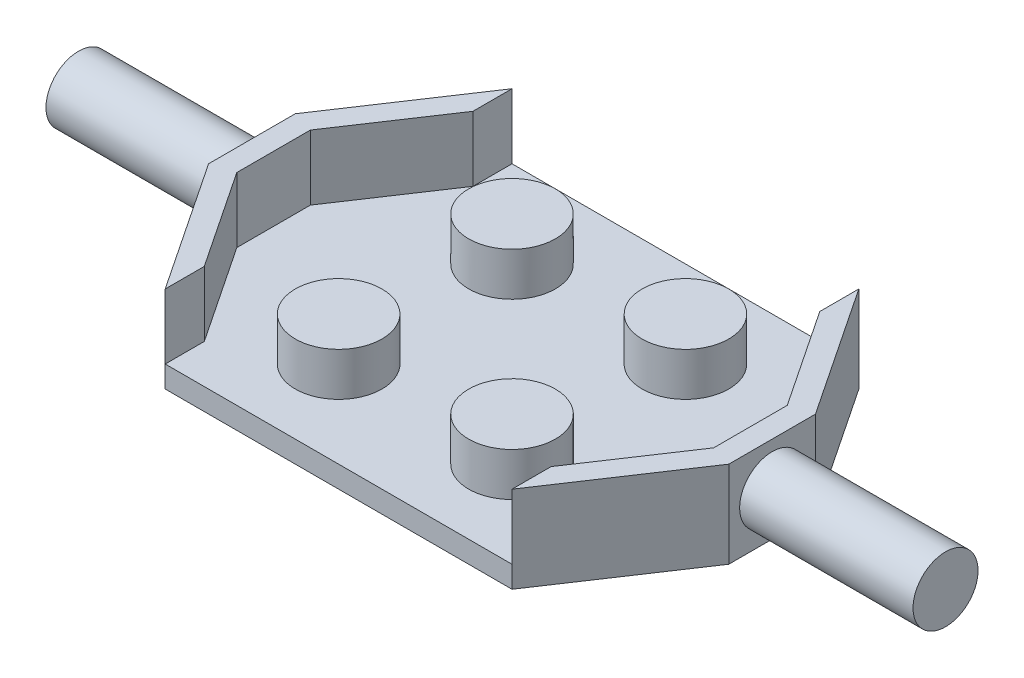
ISO-10303-21;
HEADER;
FILE_DESCRIPTION(('STEP AP214'),'2;1');
FILE_NAME('part.step','',(''),(''),'','','');
FILE_SCHEMA(('AUTOMOTIVE_DESIGN { 1 0 10303 214 1 1 1 1 }'));
ENDSEC;
DATA;
#1=APPLICATION_CONTEXT('core data for automotive mechanical design processes');
#2=APPLICATION_PROTOCOL_DEFINITION('international standard','automotive_design',2000,#1);
#3=PRODUCT_CONTEXT('',#1,'mechanical');
#4=PRODUCT('Part','Part','',(#3));
#5=PRODUCT_RELATED_PRODUCT_CATEGORY('part','',(#4));
#6=PRODUCT_DEFINITION_FORMATION('','',#4);
#7=PRODUCT_DEFINITION_CONTEXT('part definition',#1,'design');
#8=PRODUCT_DEFINITION('design','',#6,#7);
#9=PRODUCT_DEFINITION_SHAPE('','',#8);
#10=(LENGTH_UNIT() NAMED_UNIT(*) SI_UNIT(.MILLI.,.METRE.));
#11=(NAMED_UNIT(*) PLANE_ANGLE_UNIT() SI_UNIT($,.RADIAN.));
#12=(NAMED_UNIT(*) SI_UNIT($,.STERADIAN.) SOLID_ANGLE_UNIT());
#13=UNCERTAINTY_MEASURE_WITH_UNIT(LENGTH_MEASURE(1.E-05),#10,'distance_accuracy_value','');
#14=(GEOMETRIC_REPRESENTATION_CONTEXT(3) GLOBAL_UNCERTAINTY_ASSIGNED_CONTEXT((#13)) GLOBAL_UNIT_ASSIGNED_CONTEXT((#10,
#11,#12)) REPRESENTATION_CONTEXT('',''));
#15=CARTESIAN_POINT('',(0.,0.,0.));
#16=DIRECTION('',(0.,0.,1.));
#17=DIRECTION('',(1.,0.,0.));
#18=AXIS2_PLACEMENT_3D('',#15,#16,#17);
#19=CARTESIAN_POINT('',(-12.,1.,2.));
#20=DIRECTION('',(1.,0.,0.));
#21=DIRECTION('',(0.,0.,-1.));
#22=AXIS2_PLACEMENT_3D('',#19,#20,#21);
#23=PLANE('',#22);
#24=DIRECTION('',(0.,0.,1.));
#25=VECTOR('',#24,1.);
#26=CARTESIAN_POINT('',(-12.,0.,2.));
#27=LINE('',#26,#25);
#28=CARTESIAN_POINT('',(-12.,0.,-2.));
#29=VERTEX_POINT('',#28);
#30=CARTESIAN_POINT('',(-12.,0.,2.));
#31=VERTEX_POINT('',#30);
#32=EDGE_CURVE('E319',#29,#31,#27,.T.);
#33=ORIENTED_EDGE('',*,*,#32,.T.);
#34=DIRECTION('',(0.,-1.,0.));
#35=VECTOR('',#34,1.);
#36=CARTESIAN_POINT('',(-12.,1.,2.));
#37=LINE('',#36,#35);
#38=CARTESIAN_POINT('',(-12.,4.,2.));
#39=VERTEX_POINT('',#38);
#40=EDGE_CURVE('E326',#39,#31,#37,.T.);
#41=ORIENTED_EDGE('',*,*,#40,.F.);
#42=DIRECTION('',(0.,0.,1.));
#43=VECTOR('',#42,1.);
#44=CARTESIAN_POINT('',(-12.,4.,-2.));
#45=LINE('',#44,#43);
#46=CARTESIAN_POINT('',(-12.,4.,-2.));
#47=VERTEX_POINT('',#46);
#48=EDGE_CURVE('E272',#47,#39,#45,.T.);
#49=ORIENTED_EDGE('',*,*,#48,.F.);
#50=DIRECTION('',(0.,-1.,0.));
#51=VECTOR('',#50,1.);
#52=CARTESIAN_POINT('',(-12.,1.,-2.));
#53=LINE('',#52,#51);
#54=EDGE_CURVE('E329',#47,#29,#53,.T.);
#55=ORIENTED_EDGE('',*,*,#54,.T.);
#56=EDGE_LOOP('',(#33,#41,#49,#55));
#57=FACE_BOUND('',#56,.T.);
#58=CARTESIAN_POINT('',(-12.,2.,0.));
#59=DIRECTION('',(1.,0.,0.));
#60=DIRECTION('',(0.,0.,-1.));
#61=AXIS2_PLACEMENT_3D('',#58,#59,#60);
#62=CIRCLE('',#61,1.5);
#63=CARTESIAN_POINT('',(-12.,2.,-1.5));
#64=VERTEX_POINT('',#63);
#65=EDGE_CURVE('E40',#64,#64,#62,.F.);
#66=ORIENTED_EDGE('',*,*,#65,.F.);
#67=EDGE_LOOP('',(#66));
#68=FACE_BOUND('',#67,.T.);
#69=ADVANCED_FACE('F32',(#57,#68),#23,.F.);
#70=CARTESIAN_POINT('',(0.,1.,0.));
#71=DIRECTION('',(0.,-1.,0.));
#72=DIRECTION('',(0.,0.,-1.));
#73=AXIS2_PLACEMENT_3D('',#70,#71,#72);
#74=PLANE('',#73);
#75=CARTESIAN_POINT('',(4.,1.,4.));
#76=DIRECTION('',(0.,-1.,0.));
#77=DIRECTION('',(0.,0.,-1.));
#78=AXIS2_PLACEMENT_3D('',#75,#76,#77);
#79=CIRCLE('',#78,2.);
#80=CARTESIAN_POINT('',(4.,1.,2.));
#81=VERTEX_POINT('',#80);
#82=EDGE_CURVE('E228',#81,#81,#79,.T.);
#83=ORIENTED_EDGE('',*,*,#82,.T.);
#84=EDGE_LOOP('',(#83));
#85=FACE_BOUND('',#84,.T.);
#86=CARTESIAN_POINT('',(4.,1.,-4.));
#87=DIRECTION('',(0.,-1.,0.));
#88=DIRECTION('',(0.,0.,1.));
#89=AXIS2_PLACEMENT_3D('',#86,#87,#88);
#90=CIRCLE('',#89,2.);
#91=CARTESIAN_POINT('',(4.,1.,-2.));
#92=VERTEX_POINT('',#91);
#93=EDGE_CURVE('E232',#92,#92,#90,.T.);
#94=ORIENTED_EDGE('',*,*,#93,.T.);
#95=EDGE_LOOP('',(#94));
#96=FACE_BOUND('',#95,.T.);
#97=CARTESIAN_POINT('',(-4.,1.,4.));
#98=DIRECTION('',(0.,-1.,0.));
#99=DIRECTION('',(0.,0.,-1.));
#100=AXIS2_PLACEMENT_3D('',#97,#98,#99);
#101=CIRCLE('',#100,2.);
#102=CARTESIAN_POINT('',(-4.,1.,2.));
#103=VERTEX_POINT('',#102);
#104=EDGE_CURVE('E338',#103,#103,#101,.F.);
#105=ORIENTED_EDGE('',*,*,#104,.F.);
#106=EDGE_LOOP('',(#105));
#107=FACE_BOUND('',#106,.T.);
#108=CARTESIAN_POINT('',(-4.,1.,-4.));
#109=DIRECTION('',(0.,-1.,0.));
#110=DIRECTION('',(0.,0.,-1.));
#111=AXIS2_PLACEMENT_3D('',#108,#109,#110);
#112=CIRCLE('',#111,2.);
#113=CARTESIAN_POINT('',(-4.,1.,-6.));
#114=VERTEX_POINT('',#113);
#115=EDGE_CURVE('E335',#114,#114,#112,.F.);
#116=ORIENTED_EDGE('',*,*,#115,.F.);
#117=EDGE_LOOP('',(#116));
#118=FACE_BOUND('',#117,.T.);
#119=DIRECTION('',(-0.55470019622523,0.,-0.832050294337843));
#120=VECTOR('',#119,1.);
#121=CARTESIAN_POINT('',(8.,1.,-6.19722436226801));
#122=LINE('',#121,#120);
#123=CARTESIAN_POINT('',(11.,1.,-1.69722436226801));
#124=VERTEX_POINT('',#123);
#125=CARTESIAN_POINT('',(8.,1.,-6.19722436226801));
#126=VERTEX_POINT('',#125);
#127=EDGE_CURVE('E205',#124,#126,#122,.T.);
#128=ORIENTED_EDGE('',*,*,#127,.T.);
#129=DIRECTION('',(0.,0.,-1.));
#130=VECTOR('',#129,1.);
#131=CARTESIAN_POINT('',(8.,1.,-8.));
#132=LINE('',#131,#130);
#133=CARTESIAN_POINT('',(8.,1.,-8.));
#134=VERTEX_POINT('',#133);
#135=EDGE_CURVE('E202',#126,#134,#132,.T.);
#136=ORIENTED_EDGE('',*,*,#135,.T.);
#137=DIRECTION('',(-1.,0.,0.));
#138=VECTOR('',#137,1.);
#139=CARTESIAN_POINT('',(0.,1.,-8.));
#140=LINE('',#139,#138);
#141=CARTESIAN_POINT('',(-8.,1.,-8.));
#142=VERTEX_POINT('',#141);
#143=EDGE_CURVE('E308',#134,#142,#140,.T.);
#144=ORIENTED_EDGE('',*,*,#143,.T.);
#145=DIRECTION('',(0.,0.,-1.));
#146=VECTOR('',#145,1.);
#147=CARTESIAN_POINT('',(-8.,1.,-8.));
#148=LINE('',#147,#146);
#149=CARTESIAN_POINT('',(-8.,1.,-6.197224362268));
#150=VERTEX_POINT('',#149);
#151=EDGE_CURVE('E259',#150,#142,#148,.T.);
#152=ORIENTED_EDGE('',*,*,#151,.F.);
#153=DIRECTION('',(0.554700196225229,0.,-0.832050294337843));
#154=VECTOR('',#153,1.);
#155=CARTESIAN_POINT('',(-8.,1.,-6.197224362268));
#156=LINE('',#155,#154);
#157=CARTESIAN_POINT('',(-11.,1.,-1.69722436226801));
#158=VERTEX_POINT('',#157);
#159=EDGE_CURVE('E279',#158,#150,#156,.T.);
#160=ORIENTED_EDGE('',*,*,#159,.F.);
#161=DIRECTION('',(0.,0.,-1.));
#162=VECTOR('',#161,1.);
#163=CARTESIAN_POINT('',(-11.,1.,-1.69722436226801));
#164=LINE('',#163,#162);
#165=CARTESIAN_POINT('',(-11.,1.,1.69722436226801));
#166=VERTEX_POINT('',#165);
#167=EDGE_CURVE('E52',#166,#158,#164,.T.);
#168=ORIENTED_EDGE('',*,*,#167,.F.);
#169=DIRECTION('',(-0.55470019622523,0.,-0.832050294337843));
#170=VECTOR('',#169,1.);
#171=CARTESIAN_POINT('',(-11.,1.,1.69722436226801));
#172=LINE('',#171,#170);
#173=CARTESIAN_POINT('',(-8.,1.,6.19722436226801));
#174=VERTEX_POINT('',#173);
#175=EDGE_CURVE('E47',#174,#166,#172,.T.);
#176=ORIENTED_EDGE('',*,*,#175,.F.);
#177=DIRECTION('',(0.,0.,-1.));
#178=VECTOR('',#177,1.);
#179=CARTESIAN_POINT('',(-8.,1.,8.));
#180=LINE('',#179,#178);
#181=CARTESIAN_POINT('',(-8.,1.,8.));
#182=VERTEX_POINT('',#181);
#183=EDGE_CURVE('E254',#182,#174,#180,.T.);
#184=ORIENTED_EDGE('',*,*,#183,.F.);
#185=DIRECTION('',(1.,0.,0.));
#186=VECTOR('',#185,1.);
#187=CARTESIAN_POINT('',(0.,1.,8.));
#188=LINE('',#187,#186);
#189=CARTESIAN_POINT('',(8.,1.,8.));
#190=VERTEX_POINT('',#189);
#191=EDGE_CURVE('E310',#182,#190,#188,.T.);
#192=ORIENTED_EDGE('',*,*,#191,.T.);
#193=DIRECTION('',(0.,0.,-1.));
#194=VECTOR('',#193,1.);
#195=CARTESIAN_POINT('',(8.,1.,8.));
#196=LINE('',#195,#194);
#197=CARTESIAN_POINT('',(8.,1.,6.19722436226801));
#198=VERTEX_POINT('',#197);
#199=EDGE_CURVE('E180',#190,#198,#196,.T.);
#200=ORIENTED_EDGE('',*,*,#199,.T.);
#201=DIRECTION('',(0.554700196225229,0.,-0.832050294337843));
#202=VECTOR('',#201,1.);
#203=CARTESIAN_POINT('',(11.,1.,1.697224362268));
#204=LINE('',#203,#202);
#205=CARTESIAN_POINT('',(11.,1.,1.697224362268));
#206=VERTEX_POINT('',#205);
#207=EDGE_CURVE('E212',#198,#206,#204,.T.);
#208=ORIENTED_EDGE('',*,*,#207,.T.);
#209=DIRECTION('',(0.,0.,-1.));
#210=VECTOR('',#209,1.);
#211=CARTESIAN_POINT('',(11.,1.,-1.69722436226801));
#212=LINE('',#211,#210);
#213=EDGE_CURVE('E209',#206,#124,#212,.T.);
#214=ORIENTED_EDGE('',*,*,#213,.T.);
#215=EDGE_LOOP('',(#128,#136,#144,#152,#160,#168,#176,#184,#192,#200,#208,#214));
#216=FACE_BOUND('',#215,.T.);
#217=ADVANCED_FACE('F346',(#85,#96,#107,#118,#216),#74,.F.);
#218=CARTESIAN_POINT('',(0.,1.,-8.));
#219=DIRECTION('',(0.,0.,1.));
#220=DIRECTION('',(1.,0.,0.));
#221=AXIS2_PLACEMENT_3D('',#218,#219,#220);
#222=PLANE('',#221);
#223=DIRECTION('',(-1.,0.,0.));
#224=VECTOR('',#223,1.);
#225=CARTESIAN_POINT('',(0.,0.,-8.));
#226=LINE('',#225,#224);
#227=CARTESIAN_POINT('',(8.,0.,-8.));
#228=VERTEX_POINT('',#227);
#229=CARTESIAN_POINT('',(-8.,0.,-8.));
#230=VERTEX_POINT('',#229);
#231=EDGE_CURVE('E307',#228,#230,#226,.T.);
#232=ORIENTED_EDGE('',*,*,#231,.T.);
#233=DIRECTION('',(0.,-1.,0.));
#234=VECTOR('',#233,1.);
#235=CARTESIAN_POINT('',(-8.,1.,-8.));
#236=LINE('',#235,#234);
#237=EDGE_CURVE('E332',#142,#230,#236,.T.);
#238=ORIENTED_EDGE('',*,*,#237,.F.);
#239=ORIENTED_EDGE('',*,*,#143,.F.);
#240=DIRECTION('',(0.,-1.,0.));
#241=VECTOR('',#240,1.);
#242=CARTESIAN_POINT('',(8.,1.,-8.));
#243=LINE('',#242,#241);
#244=EDGE_CURVE('E246',#134,#228,#243,.T.);
#245=ORIENTED_EDGE('',*,*,#244,.T.);
#246=EDGE_LOOP('',(#232,#238,#239,#245));
#247=FACE_BOUND('',#246,.T.);
#248=ADVANCED_FACE('F34',(#247),#222,.F.);
#249=CARTESIAN_POINT('',(-8.,1.,-8.));
#250=DIRECTION('',(0.832050294337844,0.,0.554700196225229));
#251=DIRECTION('',(0.554700196225229,0.,-0.832050294337844));
#252=AXIS2_PLACEMENT_3D('',#249,#250,#251);
#253=PLANE('',#252);
#254=DIRECTION('',(-0.554700196225229,0.,0.832050294337844));
#255=VECTOR('',#254,1.);
#256=CARTESIAN_POINT('',(-8.,0.,-8.));
#257=LINE('',#256,#255);
#258=EDGE_CURVE('E317',#230,#29,#257,.T.);
#259=ORIENTED_EDGE('',*,*,#258,.T.);
#260=ORIENTED_EDGE('',*,*,#54,.F.);
#261=DIRECTION('',(-0.554700196225229,0.,0.832050294337844));
#262=VECTOR('',#261,1.);
#263=CARTESIAN_POINT('',(-8.,4.,-8.));
#264=LINE('',#263,#262);
#265=CARTESIAN_POINT('',(-8.,4.,-8.));
#266=VERTEX_POINT('',#265);
#267=EDGE_CURVE('E269',#266,#47,#264,.T.);
#268=ORIENTED_EDGE('',*,*,#267,.F.);
#269=DIRECTION('',(0.,-1.,0.));
#270=VECTOR('',#269,1.);
#271=CARTESIAN_POINT('',(-8.,4.,-8.));
#272=LINE('',#271,#270);
#273=EDGE_CURVE('E275',#266,#142,#272,.T.);
#274=ORIENTED_EDGE('',*,*,#273,.T.);
#275=ORIENTED_EDGE('',*,*,#237,.T.);
#276=EDGE_LOOP('',(#259,#260,#268,#274,#275));
#277=FACE_BOUND('',#276,.T.);
#278=ADVANCED_FACE('F357',(#277),#253,.F.);
#279=CARTESIAN_POINT('',(-8.,1.,8.));
#280=DIRECTION('',(0.832050294337843,0.,-0.55470019622523));
#281=DIRECTION('',(-0.55470019622523,0.,-0.832050294337843));
#282=AXIS2_PLACEMENT_3D('',#279,#280,#281);
#283=PLANE('',#282);
#284=DIRECTION('',(0.55470019622523,0.,0.832050294337843));
#285=VECTOR('',#284,1.);
#286=CARTESIAN_POINT('',(-8.,0.,8.));
#287=LINE('',#286,#285);
#288=CARTESIAN_POINT('',(-8.,0.,8.));
#289=VERTEX_POINT('',#288);
#290=EDGE_CURVE('E321',#31,#289,#287,.T.);
#291=ORIENTED_EDGE('',*,*,#290,.T.);
#292=DIRECTION('',(0.,-1.,0.));
#293=VECTOR('',#292,1.);
#294=CARTESIAN_POINT('',(-8.,1.,8.));
#295=LINE('',#294,#293);
#296=EDGE_CURVE('E314',#182,#289,#295,.T.);
#297=ORIENTED_EDGE('',*,*,#296,.F.);
#298=DIRECTION('',(0.,-1.,0.));
#299=VECTOR('',#298,1.);
#300=CARTESIAN_POINT('',(-8.,4.,8.));
#301=LINE('',#300,#299);
#302=CARTESIAN_POINT('',(-8.,4.,8.));
#303=VERTEX_POINT('',#302);
#304=EDGE_CURVE('E298',#303,#182,#301,.T.);
#305=ORIENTED_EDGE('',*,*,#304,.F.);
#306=DIRECTION('',(0.55470019622523,0.,0.832050294337843));
#307=VECTOR('',#306,1.);
#308=CARTESIAN_POINT('',(-12.,4.,2.));
#309=LINE('',#308,#307);
#310=EDGE_CURVE('E255',#39,#303,#309,.T.);
#311=ORIENTED_EDGE('',*,*,#310,.F.);
#312=ORIENTED_EDGE('',*,*,#40,.T.);
#313=EDGE_LOOP('',(#291,#297,#305,#311,#312));
#314=FACE_BOUND('',#313,.T.);
#315=ADVANCED_FACE('F355',(#314),#283,.F.);
#316=CARTESIAN_POINT('',(0.,1.,8.));
#317=DIRECTION('',(0.,0.,-1.));
#318=DIRECTION('',(-1.,0.,0.));
#319=AXIS2_PLACEMENT_3D('',#316,#317,#318);
#320=PLANE('',#319);
#321=DIRECTION('',(1.,0.,0.));
#322=VECTOR('',#321,1.);
#323=CARTESIAN_POINT('',(0.,0.,8.));
#324=LINE('',#323,#322);
#325=CARTESIAN_POINT('',(8.,0.,8.));
#326=VERTEX_POINT('',#325);
#327=EDGE_CURVE('E311',#289,#326,#324,.T.);
#328=ORIENTED_EDGE('',*,*,#327,.T.);
#329=DIRECTION('',(0.,-1.,0.));
#330=VECTOR('',#329,1.);
#331=CARTESIAN_POINT('',(8.,1.,8.));
#332=LINE('',#331,#330);
#333=EDGE_CURVE('E168',#190,#326,#332,.T.);
#334=ORIENTED_EDGE('',*,*,#333,.F.);
#335=ORIENTED_EDGE('',*,*,#191,.F.);
#336=ORIENTED_EDGE('',*,*,#296,.T.);
#337=EDGE_LOOP('',(#328,#334,#335,#336));
#338=FACE_BOUND('',#337,.T.);
#339=ADVANCED_FACE('F364',(#338),#320,.F.);
#340=CARTESIAN_POINT('',(0.,0.,0.));
#341=DIRECTION('',(0.,-1.,0.));
#342=DIRECTION('',(0.,0.,-1.));
#343=AXIS2_PLACEMENT_3D('',#340,#341,#342);
#344=PLANE('',#343);
#345=ORIENTED_EDGE('',*,*,#231,.F.);
#346=DIRECTION('',(0.554700196225229,0.,0.832050294337843));
#347=VECTOR('',#346,1.);
#348=CARTESIAN_POINT('',(8.,0.,-8.));
#349=LINE('',#348,#347);
#350=CARTESIAN_POINT('',(12.,0.,-2.));
#351=VERTEX_POINT('',#350);
#352=EDGE_CURVE('E243',#228,#351,#349,.T.);
#353=ORIENTED_EDGE('',*,*,#352,.T.);
#354=DIRECTION('',(0.,0.,1.));
#355=VECTOR('',#354,1.);
#356=CARTESIAN_POINT('',(12.,0.,2.));
#357=LINE('',#356,#355);
#358=CARTESIAN_POINT('',(12.,0.,2.));
#359=VERTEX_POINT('',#358);
#360=EDGE_CURVE('E241',#351,#359,#357,.T.);
#361=ORIENTED_EDGE('',*,*,#360,.T.);
#362=DIRECTION('',(-0.554700196225229,0.,0.832050294337843));
#363=VECTOR('',#362,1.);
#364=CARTESIAN_POINT('',(8.,0.,8.));
#365=LINE('',#364,#363);
#366=EDGE_CURVE('E163',#359,#326,#365,.T.);
#367=ORIENTED_EDGE('',*,*,#366,.T.);
#368=ORIENTED_EDGE('',*,*,#327,.F.);
#369=ORIENTED_EDGE('',*,*,#290,.F.);
#370=ORIENTED_EDGE('',*,*,#32,.F.);
#371=ORIENTED_EDGE('',*,*,#258,.F.);
#372=EDGE_LOOP('',(#345,#353,#361,#367,#368,#369,#370,#371));
#373=FACE_BOUND('',#372,.T.);
#374=ADVANCED_FACE('F373',(#373),#344,.T.);
#375=CARTESIAN_POINT('',(-4.,3.,-4.));
#376=DIRECTION('',(0.,-1.,0.));
#377=DIRECTION('',(0.,0.,-1.));
#378=AXIS2_PLACEMENT_3D('',#375,#376,#377);
#379=CYLINDRICAL_SURFACE('',#378,2.);
#380=CARTESIAN_POINT('',(-4.,3.,-4.));
#381=DIRECTION('',(0.,1.,0.));
#382=DIRECTION('',(0.,0.,1.));
#383=AXIS2_PLACEMENT_3D('',#380,#381,#382);
#384=CIRCLE('',#383,2.);
#385=CARTESIAN_POINT('',(-4.,3.,-2.));
#386=VERTEX_POINT('',#385);
#387=EDGE_CURVE('E304',#386,#386,#384,.T.);
#388=ORIENTED_EDGE('',*,*,#387,.F.);
#389=EDGE_LOOP('',(#388));
#390=FACE_BOUND('',#389,.T.);
#391=ORIENTED_EDGE('',*,*,#115,.T.);
#392=EDGE_LOOP('',(#391));
#393=FACE_BOUND('',#392,.T.);
#394=ADVANCED_FACE('F424',(#390,#393),#379,.T.);
#395=CARTESIAN_POINT('',(-4.,3.,-4.));
#396=DIRECTION('',(0.,1.,0.));
#397=DIRECTION('',(0.,0.,1.));
#398=AXIS2_PLACEMENT_3D('',#395,#396,#397);
#399=PLANE('',#398);
#400=ORIENTED_EDGE('',*,*,#387,.T.);
#401=EDGE_LOOP('',(#400));
#402=FACE_BOUND('',#401,.T.);
#403=ADVANCED_FACE('F420',(#402),#399,.T.);
#404=CARTESIAN_POINT('',(-4.,3.,4.));
#405=DIRECTION('',(0.,-1.,0.));
#406=DIRECTION('',(0.,0.,-1.));
#407=AXIS2_PLACEMENT_3D('',#404,#405,#406);
#408=CYLINDRICAL_SURFACE('',#407,2.);
#409=CARTESIAN_POINT('',(-4.,3.,4.));
#410=DIRECTION('',(0.,1.,0.));
#411=DIRECTION('',(0.,0.,-1.));
#412=AXIS2_PLACEMENT_3D('',#409,#410,#411);
#413=CIRCLE('',#412,2.);
#414=CARTESIAN_POINT('',(-4.,3.,2.));
#415=VERTEX_POINT('',#414);
#416=EDGE_CURVE('E301',#415,#415,#413,.T.);
#417=ORIENTED_EDGE('',*,*,#416,.F.);
#418=EDGE_LOOP('',(#417));
#419=FACE_BOUND('',#418,.T.);
#420=ORIENTED_EDGE('',*,*,#104,.T.);
#421=EDGE_LOOP('',(#420));
#422=FACE_BOUND('',#421,.T.);
#423=ADVANCED_FACE('F416',(#419,#422),#408,.T.);
#424=CARTESIAN_POINT('',(-4.,3.,4.));
#425=DIRECTION('',(0.,-1.,0.));
#426=DIRECTION('',(0.,0.,-1.));
#427=AXIS2_PLACEMENT_3D('',#424,#425,#426);
#428=PLANE('',#427);
#429=ORIENTED_EDGE('',*,*,#416,.T.);
#430=EDGE_LOOP('',(#429));
#431=FACE_BOUND('',#430,.T.);
#432=ADVANCED_FACE('F410',(#431),#428,.F.);
#433=CARTESIAN_POINT('',(-8.,4.,8.));
#434=DIRECTION('',(-1.,0.,0.));
#435=DIRECTION('',(0.,0.,1.));
#436=AXIS2_PLACEMENT_3D('',#433,#434,#435);
#437=PLANE('',#436);
#438=ORIENTED_EDGE('',*,*,#183,.T.);
#439=DIRECTION('',(0.,-1.,0.));
#440=VECTOR('',#439,1.);
#441=CARTESIAN_POINT('',(-8.,4.,6.19722436226801));
#442=LINE('',#441,#440);
#443=CARTESIAN_POINT('',(-8.,4.,6.19722436226801));
#444=VERTEX_POINT('',#443);
#445=EDGE_CURVE('E295',#444,#174,#442,.T.);
#446=ORIENTED_EDGE('',*,*,#445,.F.);
#447=DIRECTION('',(0.,0.,-1.));
#448=VECTOR('',#447,1.);
#449=CARTESIAN_POINT('',(-8.,4.,8.));
#450=LINE('',#449,#448);
#451=EDGE_CURVE('E258',#303,#444,#450,.T.);
#452=ORIENTED_EDGE('',*,*,#451,.F.);
#453=ORIENTED_EDGE('',*,*,#304,.T.);
#454=EDGE_LOOP('',(#438,#446,#452,#453));
#455=FACE_BOUND('',#454,.T.);
#456=ADVANCED_FACE('F383',(#455),#437,.F.);
#457=CARTESIAN_POINT('',(-11.,4.,1.69722436226801));
#458=DIRECTION('',(-0.832050294337843,0.,0.554700196225229));
#459=DIRECTION('',(0.55470019622523,0.,0.832050294337843));
#460=AXIS2_PLACEMENT_3D('',#457,#458,#459);
#461=PLANE('',#460);
#462=ORIENTED_EDGE('',*,*,#175,.T.);
#463=DIRECTION('',(0.,-1.,0.));
#464=VECTOR('',#463,1.);
#465=CARTESIAN_POINT('',(-11.,4.,1.69722436226801));
#466=LINE('',#465,#464);
#467=CARTESIAN_POINT('',(-11.,4.,1.69722436226801));
#468=VERTEX_POINT('',#467);
#469=EDGE_CURVE('E292',#468,#166,#466,.T.);
#470=ORIENTED_EDGE('',*,*,#469,.F.);
#471=DIRECTION('',(-0.55470019622523,0.,-0.832050294337843));
#472=VECTOR('',#471,1.);
#473=CARTESIAN_POINT('',(-11.,4.,1.69722436226801));
#474=LINE('',#473,#472);
#475=EDGE_CURVE('E261',#444,#468,#474,.T.);
#476=ORIENTED_EDGE('',*,*,#475,.F.);
#477=ORIENTED_EDGE('',*,*,#445,.T.);
#478=EDGE_LOOP('',(#462,#470,#476,#477));
#479=FACE_BOUND('',#478,.T.);
#480=ADVANCED_FACE('F402',(#479),#461,.F.);
#481=CARTESIAN_POINT('',(-11.,4.,-1.69722436226801));
#482=DIRECTION('',(-1.,0.,0.));
#483=DIRECTION('',(0.,0.,1.));
#484=AXIS2_PLACEMENT_3D('',#481,#482,#483);
#485=PLANE('',#484);
#486=ORIENTED_EDGE('',*,*,#167,.T.);
#487=DIRECTION('',(0.,-1.,0.));
#488=VECTOR('',#487,1.);
#489=CARTESIAN_POINT('',(-11.,4.,-1.69722436226801));
#490=LINE('',#489,#488);
#491=CARTESIAN_POINT('',(-11.,4.,-1.69722436226801));
#492=VERTEX_POINT('',#491);
#493=EDGE_CURVE('E289',#492,#158,#490,.T.);
#494=ORIENTED_EDGE('',*,*,#493,.F.);
#495=DIRECTION('',(0.,0.,-1.));
#496=VECTOR('',#495,1.);
#497=CARTESIAN_POINT('',(-11.,4.,-1.69722436226801));
#498=LINE('',#497,#496);
#499=EDGE_CURVE('E263',#468,#492,#498,.T.);
#500=ORIENTED_EDGE('',*,*,#499,.F.);
#501=ORIENTED_EDGE('',*,*,#469,.T.);
#502=EDGE_LOOP('',(#486,#494,#500,#501));
#503=FACE_BOUND('',#502,.T.);
#504=ADVANCED_FACE('F398',(#503),#485,.F.);
#505=CARTESIAN_POINT('',(-8.,4.,-6.197224362268));
#506=DIRECTION('',(-0.832050294337843,0.,-0.554700196225229));
#507=DIRECTION('',(-0.554700196225229,0.,0.832050294337844));
#508=AXIS2_PLACEMENT_3D('',#505,#506,#507);
#509=PLANE('',#508);
#510=ORIENTED_EDGE('',*,*,#159,.T.);
#511=DIRECTION('',(0.,-1.,0.));
#512=VECTOR('',#511,1.);
#513=CARTESIAN_POINT('',(-8.,4.,-6.197224362268));
#514=LINE('',#513,#512);
#515=CARTESIAN_POINT('',(-8.,4.,-6.197224362268));
#516=VERTEX_POINT('',#515);
#517=EDGE_CURVE('E286',#516,#150,#514,.T.);
#518=ORIENTED_EDGE('',*,*,#517,.F.);
#519=DIRECTION('',(0.554700196225229,0.,-0.832050294337843));
#520=VECTOR('',#519,1.);
#521=CARTESIAN_POINT('',(-8.,4.,-6.197224362268));
#522=LINE('',#521,#520);
#523=EDGE_CURVE('E265',#492,#516,#522,.T.);
#524=ORIENTED_EDGE('',*,*,#523,.F.);
#525=ORIENTED_EDGE('',*,*,#493,.T.);
#526=EDGE_LOOP('',(#510,#518,#524,#525));
#527=FACE_BOUND('',#526,.T.);
#528=ADVANCED_FACE('F393',(#527),#509,.F.);
#529=CARTESIAN_POINT('',(-8.,4.,-8.));
#530=DIRECTION('',(-1.,0.,0.));
#531=DIRECTION('',(0.,0.,1.));
#532=AXIS2_PLACEMENT_3D('',#529,#530,#531);
#533=PLANE('',#532);
#534=ORIENTED_EDGE('',*,*,#151,.T.);
#535=ORIENTED_EDGE('',*,*,#273,.F.);
#536=DIRECTION('',(0.,0.,-1.));
#537=VECTOR('',#536,1.);
#538=CARTESIAN_POINT('',(-8.,4.,-8.));
#539=LINE('',#538,#537);
#540=EDGE_CURVE('E267',#516,#266,#539,.T.);
#541=ORIENTED_EDGE('',*,*,#540,.F.);
#542=ORIENTED_EDGE('',*,*,#517,.T.);
#543=EDGE_LOOP('',(#534,#535,#541,#542));
#544=FACE_BOUND('',#543,.T.);
#545=ADVANCED_FACE('F389',(#544),#533,.F.);
#546=CARTESIAN_POINT('',(0.,4.,0.));
#547=DIRECTION('',(0.,-1.,0.));
#548=DIRECTION('',(0.,0.,-1.));
#549=AXIS2_PLACEMENT_3D('',#546,#547,#548);
#550=PLANE('',#549);
#551=ORIENTED_EDGE('',*,*,#310,.T.);
#552=ORIENTED_EDGE('',*,*,#451,.T.);
#553=ORIENTED_EDGE('',*,*,#475,.T.);
#554=ORIENTED_EDGE('',*,*,#499,.T.);
#555=ORIENTED_EDGE('',*,*,#523,.T.);
#556=ORIENTED_EDGE('',*,*,#540,.T.);
#557=ORIENTED_EDGE('',*,*,#267,.T.);
#558=ORIENTED_EDGE('',*,*,#48,.T.);
#559=EDGE_LOOP('',(#551,#552,#553,#554,#555,#556,#557,#558));
#560=FACE_BOUND('',#559,.T.);
#561=ADVANCED_FACE('F385',(#560),#550,.F.);
#562=CARTESIAN_POINT('',(-20.,2.,0.));
#563=DIRECTION('',(1.,0.,0.));
#564=DIRECTION('',(0.,0.,-1.));
#565=AXIS2_PLACEMENT_3D('',#562,#563,#564);
#566=CYLINDRICAL_SURFACE('',#565,1.5);
#567=CARTESIAN_POINT('',(-20.,2.,0.));
#568=DIRECTION('',(-1.,0.,0.));
#569=DIRECTION('',(0.,0.,1.));
#570=AXIS2_PLACEMENT_3D('',#567,#568,#569);
#571=CIRCLE('',#570,1.5);
#572=CARTESIAN_POINT('',(-20.,2.,1.5));
#573=VERTEX_POINT('',#572);
#574=EDGE_CURVE('E251',#573,#573,#571,.T.);
#575=ORIENTED_EDGE('',*,*,#574,.F.);
#576=EDGE_LOOP('',(#575));
#577=FACE_BOUND('',#576,.T.);
#578=ORIENTED_EDGE('',*,*,#65,.T.);
#579=EDGE_LOOP('',(#578));
#580=FACE_BOUND('',#579,.T.);
#581=ADVANCED_FACE('F343',(#577,#580),#566,.T.);
#582=CARTESIAN_POINT('',(-20.,2.,0.));
#583=DIRECTION('',(-1.,0.,0.));
#584=DIRECTION('',(0.,0.,1.));
#585=AXIS2_PLACEMENT_3D('',#582,#583,#584);
#586=PLANE('',#585);
#587=ORIENTED_EDGE('',*,*,#574,.T.);
#588=EDGE_LOOP('',(#587));
#589=FACE_BOUND('',#588,.T.);
#590=ADVANCED_FACE('F510',(#589),#586,.T.);
#591=CARTESIAN_POINT('',(8.,1.,8.));
#592=DIRECTION('',(0.832050294337843,0.,0.554700196225229));
#593=DIRECTION('',(0.554700196225229,0.,-0.832050294337843));
#594=AXIS2_PLACEMENT_3D('',#591,#592,#593);
#595=PLANE('',#594);
#596=ORIENTED_EDGE('',*,*,#366,.F.);
#597=DIRECTION('',(0.,-1.,0.));
#598=VECTOR('',#597,1.);
#599=CARTESIAN_POINT('',(12.,1.,2.));
#600=LINE('',#599,#598);
#601=CARTESIAN_POINT('',(12.,4.,2.));
#602=VERTEX_POINT('',#601);
#603=EDGE_CURVE('E156',#602,#359,#600,.T.);
#604=ORIENTED_EDGE('',*,*,#603,.F.);
#605=DIRECTION('',(-0.554700196225229,0.,0.832050294337843));
#606=VECTOR('',#605,1.);
#607=CARTESIAN_POINT('',(12.,4.,2.));
#608=LINE('',#607,#606);
#609=CARTESIAN_POINT('',(8.,4.,8.));
#610=VERTEX_POINT('',#609);
#611=EDGE_CURVE('E159',#602,#610,#608,.T.);
#612=ORIENTED_EDGE('',*,*,#611,.T.);
#613=DIRECTION('',(0.,-1.,0.));
#614=VECTOR('',#613,1.);
#615=CARTESIAN_POINT('',(8.,4.,8.));
#616=LINE('',#615,#614);
#617=EDGE_CURVE('E201',#610,#190,#616,.T.);
#618=ORIENTED_EDGE('',*,*,#617,.T.);
#619=ORIENTED_EDGE('',*,*,#333,.T.);
#620=EDGE_LOOP('',(#596,#604,#612,#618,#619));
#621=FACE_BOUND('',#620,.T.);
#622=ADVANCED_FACE('F158',(#621),#595,.T.);
#623=CARTESIAN_POINT('',(12.,1.,2.));
#624=DIRECTION('',(1.,0.,0.));
#625=DIRECTION('',(0.,0.,-1.));
#626=AXIS2_PLACEMENT_3D('',#623,#624,#625);
#627=PLANE('',#626);
#628=CARTESIAN_POINT('',(12.,2.,0.));
#629=DIRECTION('',(1.,0.,0.));
#630=DIRECTION('',(0.,0.,-1.));
#631=AXIS2_PLACEMENT_3D('',#628,#629,#630);
#632=CIRCLE('',#631,1.5);
#633=CARTESIAN_POINT('',(12.,2.,-1.5));
#634=VERTEX_POINT('',#633);
#635=EDGE_CURVE('E11',#634,#634,#632,.T.);
#636=ORIENTED_EDGE('',*,*,#635,.F.);
#637=EDGE_LOOP('',(#636));
#638=FACE_BOUND('',#637,.T.);
#639=ORIENTED_EDGE('',*,*,#360,.F.);
#640=DIRECTION('',(0.,-1.,0.));
#641=VECTOR('',#640,1.);
#642=CARTESIAN_POINT('',(12.,1.,-2.));
#643=LINE('',#642,#641);
#644=CARTESIAN_POINT('',(12.,4.,-2.));
#645=VERTEX_POINT('',#644);
#646=EDGE_CURVE('E169',#645,#351,#643,.T.);
#647=ORIENTED_EDGE('',*,*,#646,.F.);
#648=DIRECTION('',(0.,0.,1.));
#649=VECTOR('',#648,1.);
#650=CARTESIAN_POINT('',(12.,4.,-2.));
#651=LINE('',#650,#649);
#652=EDGE_CURVE('E175',#645,#602,#651,.T.);
#653=ORIENTED_EDGE('',*,*,#652,.T.);
#654=ORIENTED_EDGE('',*,*,#603,.T.);
#655=EDGE_LOOP('',(#639,#647,#653,#654));
#656=FACE_BOUND('',#655,.T.);
#657=ADVANCED_FACE('F182',(#638,#656),#627,.T.);
#658=CARTESIAN_POINT('',(8.,1.,-8.));
#659=DIRECTION('',(0.832050294337843,0.,-0.554700196225229));
#660=DIRECTION('',(-0.554700196225229,0.,-0.832050294337843));
#661=AXIS2_PLACEMENT_3D('',#658,#659,#660);
#662=PLANE('',#661);
#663=ORIENTED_EDGE('',*,*,#352,.F.);
#664=ORIENTED_EDGE('',*,*,#244,.F.);
#665=DIRECTION('',(0.,-1.,0.));
#666=VECTOR('',#665,1.);
#667=CARTESIAN_POINT('',(8.,4.,-8.));
#668=LINE('',#667,#666);
#669=CARTESIAN_POINT('',(8.,4.,-8.));
#670=VERTEX_POINT('',#669);
#671=EDGE_CURVE('E226',#670,#134,#668,.T.);
#672=ORIENTED_EDGE('',*,*,#671,.F.);
#673=DIRECTION('',(0.554700196225229,0.,0.832050294337843));
#674=VECTOR('',#673,1.);
#675=CARTESIAN_POINT('',(8.,4.,-8.));
#676=LINE('',#675,#674);
#677=EDGE_CURVE('E183',#670,#645,#676,.T.);
#678=ORIENTED_EDGE('',*,*,#677,.T.);
#679=ORIENTED_EDGE('',*,*,#646,.T.);
#680=EDGE_LOOP('',(#663,#664,#672,#678,#679));
#681=FACE_BOUND('',#680,.T.);
#682=ADVANCED_FACE('F566',(#681),#662,.T.);
#683=CARTESIAN_POINT('',(4.,3.,-4.));
#684=DIRECTION('',(0.,-1.,0.));
#685=DIRECTION('',(0.,0.,-1.));
#686=AXIS2_PLACEMENT_3D('',#683,#684,#685);
#687=CYLINDRICAL_SURFACE('',#686,2.);
#688=CARTESIAN_POINT('',(4.,3.,-4.));
#689=DIRECTION('',(0.,-1.,0.));
#690=DIRECTION('',(0.,0.,1.));
#691=AXIS2_PLACEMENT_3D('',#688,#689,#690);
#692=CIRCLE('',#691,2.);
#693=CARTESIAN_POINT('',(4.,3.,-2.));
#694=VERTEX_POINT('',#693);
#695=EDGE_CURVE('E235',#694,#694,#692,.T.);
#696=ORIENTED_EDGE('',*,*,#695,.T.);
#697=EDGE_LOOP('',(#696));
#698=FACE_BOUND('',#697,.T.);
#699=ORIENTED_EDGE('',*,*,#93,.F.);
#700=EDGE_LOOP('',(#699));
#701=FACE_BOUND('',#700,.T.);
#702=ADVANCED_FACE('F577',(#698,#701),#687,.T.);
#703=CARTESIAN_POINT('',(4.,3.,-4.));
#704=DIRECTION('',(0.,1.,0.));
#705=DIRECTION('',(0.,0.,1.));
#706=AXIS2_PLACEMENT_3D('',#703,#704,#705);
#707=PLANE('',#706);
#708=ORIENTED_EDGE('',*,*,#695,.F.);
#709=EDGE_LOOP('',(#708));
#710=FACE_BOUND('',#709,.T.);
#711=ADVANCED_FACE('F589',(#710),#707,.T.);
#712=CARTESIAN_POINT('',(4.,3.,4.));
#713=DIRECTION('',(0.,-1.,0.));
#714=DIRECTION('',(0.,0.,-1.));
#715=AXIS2_PLACEMENT_3D('',#712,#713,#714);
#716=CYLINDRICAL_SURFACE('',#715,2.);
#717=CARTESIAN_POINT('',(4.,3.,4.));
#718=DIRECTION('',(0.,-1.,0.));
#719=DIRECTION('',(0.,0.,-1.));
#720=AXIS2_PLACEMENT_3D('',#717,#718,#719);
#721=CIRCLE('',#720,2.);
#722=CARTESIAN_POINT('',(4.,3.,2.));
#723=VERTEX_POINT('',#722);
#724=EDGE_CURVE('E229',#723,#723,#721,.T.);
#725=ORIENTED_EDGE('',*,*,#724,.T.);
#726=EDGE_LOOP('',(#725));
#727=FACE_BOUND('',#726,.T.);
#728=ORIENTED_EDGE('',*,*,#82,.F.);
#729=EDGE_LOOP('',(#728));
#730=FACE_BOUND('',#729,.T.);
#731=ADVANCED_FACE('F598',(#727,#730),#716,.T.);
#732=CARTESIAN_POINT('',(4.,3.,4.));
#733=DIRECTION('',(0.,-1.,0.));
#734=DIRECTION('',(0.,0.,-1.));
#735=AXIS2_PLACEMENT_3D('',#732,#733,#734);
#736=PLANE('',#735);
#737=ORIENTED_EDGE('',*,*,#724,.F.);
#738=EDGE_LOOP('',(#737));
#739=FACE_BOUND('',#738,.T.);
#740=ADVANCED_FACE('F606',(#739),#736,.F.);
#741=CARTESIAN_POINT('',(8.,4.,-8.));
#742=DIRECTION('',(-1.,0.,0.));
#743=DIRECTION('',(0.,0.,1.));
#744=AXIS2_PLACEMENT_3D('',#741,#742,#743);
#745=PLANE('',#744);
#746=ORIENTED_EDGE('',*,*,#135,.F.);
#747=DIRECTION('',(0.,-1.,0.));
#748=VECTOR('',#747,1.);
#749=CARTESIAN_POINT('',(8.,4.,-6.19722436226801));
#750=LINE('',#749,#748);
#751=CARTESIAN_POINT('',(8.,4.,-6.19722436226801));
#752=VERTEX_POINT('',#751);
#753=EDGE_CURVE('E224',#752,#126,#750,.T.);
#754=ORIENTED_EDGE('',*,*,#753,.F.);
#755=DIRECTION('',(0.,0.,-1.));
#756=VECTOR('',#755,1.);
#757=CARTESIAN_POINT('',(8.,4.,-8.));
#758=LINE('',#757,#756);
#759=EDGE_CURVE('E185',#752,#670,#758,.T.);
#760=ORIENTED_EDGE('',*,*,#759,.T.);
#761=ORIENTED_EDGE('',*,*,#671,.T.);
#762=EDGE_LOOP('',(#746,#754,#760,#761));
#763=FACE_BOUND('',#762,.T.);
#764=ADVANCED_FACE('F614',(#763),#745,.T.);
#765=CARTESIAN_POINT('',(8.,4.,-6.19722436226801));
#766=DIRECTION('',(-0.832050294337843,0.,0.55470019622523));
#767=DIRECTION('',(0.55470019622523,0.,0.832050294337843));
#768=AXIS2_PLACEMENT_3D('',#765,#766,#767);
#769=PLANE('',#768);
#770=ORIENTED_EDGE('',*,*,#127,.F.);
#771=DIRECTION('',(0.,-1.,0.));
#772=VECTOR('',#771,1.);
#773=CARTESIAN_POINT('',(11.,4.,-1.69722436226801));
#774=LINE('',#773,#772);
#775=CARTESIAN_POINT('',(11.,4.,-1.69722436226801));
#776=VERTEX_POINT('',#775);
#777=EDGE_CURVE('E222',#776,#124,#774,.T.);
#778=ORIENTED_EDGE('',*,*,#777,.F.);
#779=DIRECTION('',(-0.55470019622523,0.,-0.832050294337843));
#780=VECTOR('',#779,1.);
#781=CARTESIAN_POINT('',(8.,4.,-6.19722436226801));
#782=LINE('',#781,#780);
#783=EDGE_CURVE('E191',#776,#752,#782,.T.);
#784=ORIENTED_EDGE('',*,*,#783,.T.);
#785=ORIENTED_EDGE('',*,*,#753,.T.);
#786=EDGE_LOOP('',(#770,#778,#784,#785));
#787=FACE_BOUND('',#786,.T.);
#788=ADVANCED_FACE('F623',(#787),#769,.T.);
#789=CARTESIAN_POINT('',(11.,4.,-1.69722436226801));
#790=DIRECTION('',(-1.,0.,0.));
#791=DIRECTION('',(0.,0.,1.));
#792=AXIS2_PLACEMENT_3D('',#789,#790,#791);
#793=PLANE('',#792);
#794=ORIENTED_EDGE('',*,*,#213,.F.);
#795=DIRECTION('',(0.,-1.,0.));
#796=VECTOR('',#795,1.);
#797=CARTESIAN_POINT('',(11.,4.,1.697224362268));
#798=LINE('',#797,#796);
#799=CARTESIAN_POINT('',(11.,4.,1.697224362268));
#800=VERTEX_POINT('',#799);
#801=EDGE_CURVE('E220',#800,#206,#798,.T.);
#802=ORIENTED_EDGE('',*,*,#801,.F.);
#803=DIRECTION('',(0.,0.,-1.));
#804=VECTOR('',#803,1.);
#805=CARTESIAN_POINT('',(11.,4.,-1.69722436226801));
#806=LINE('',#805,#804);
#807=EDGE_CURVE('E194',#800,#776,#806,.T.);
#808=ORIENTED_EDGE('',*,*,#807,.T.);
#809=ORIENTED_EDGE('',*,*,#777,.T.);
#810=EDGE_LOOP('',(#794,#802,#808,#809));
#811=FACE_BOUND('',#810,.T.);
#812=ADVANCED_FACE('F633',(#811),#793,.T.);
#813=CARTESIAN_POINT('',(11.,4.,1.697224362268));
#814=DIRECTION('',(-0.832050294337843,0.,-0.554700196225229));
#815=DIRECTION('',(-0.554700196225229,0.,0.832050294337844));
#816=AXIS2_PLACEMENT_3D('',#813,#814,#815);
#817=PLANE('',#816);
#818=ORIENTED_EDGE('',*,*,#207,.F.);
#819=DIRECTION('',(0.,-1.,0.));
#820=VECTOR('',#819,1.);
#821=CARTESIAN_POINT('',(8.,4.,6.19722436226801));
#822=LINE('',#821,#820);
#823=CARTESIAN_POINT('',(8.,4.,6.19722436226801));
#824=VERTEX_POINT('',#823);
#825=EDGE_CURVE('E218',#824,#198,#822,.T.);
#826=ORIENTED_EDGE('',*,*,#825,.F.);
#827=DIRECTION('',(0.554700196225229,0.,-0.832050294337843));
#828=VECTOR('',#827,1.);
#829=CARTESIAN_POINT('',(11.,4.,1.697224362268));
#830=LINE('',#829,#828);
#831=EDGE_CURVE('E197',#824,#800,#830,.T.);
#832=ORIENTED_EDGE('',*,*,#831,.T.);
#833=ORIENTED_EDGE('',*,*,#801,.T.);
#834=EDGE_LOOP('',(#818,#826,#832,#833));
#835=FACE_BOUND('',#834,.T.);
#836=ADVANCED_FACE('F643',(#835),#817,.T.);
#837=CARTESIAN_POINT('',(8.,4.,8.));
#838=DIRECTION('',(-1.,0.,0.));
#839=DIRECTION('',(0.,0.,1.));
#840=AXIS2_PLACEMENT_3D('',#837,#838,#839);
#841=PLANE('',#840);
#842=ORIENTED_EDGE('',*,*,#199,.F.);
#843=ORIENTED_EDGE('',*,*,#617,.F.);
#844=DIRECTION('',(0.,0.,-1.));
#845=VECTOR('',#844,1.);
#846=CARTESIAN_POINT('',(8.,4.,8.));
#847=LINE('',#846,#845);
#848=EDGE_CURVE('E179',#610,#824,#847,.T.);
#849=ORIENTED_EDGE('',*,*,#848,.T.);
#850=ORIENTED_EDGE('',*,*,#825,.T.);
#851=EDGE_LOOP('',(#842,#843,#849,#850));
#852=FACE_BOUND('',#851,.T.);
#853=ADVANCED_FACE('F653',(#852),#841,.T.);
#854=CARTESIAN_POINT('',(0.,4.,0.));
#855=DIRECTION('',(0.,-1.,0.));
#856=DIRECTION('',(0.,0.,-1.));
#857=AXIS2_PLACEMENT_3D('',#854,#855,#856);
#858=PLANE('',#857);
#859=ORIENTED_EDGE('',*,*,#611,.F.);
#860=ORIENTED_EDGE('',*,*,#652,.F.);
#861=ORIENTED_EDGE('',*,*,#677,.F.);
#862=ORIENTED_EDGE('',*,*,#759,.F.);
#863=ORIENTED_EDGE('',*,*,#783,.F.);
#864=ORIENTED_EDGE('',*,*,#807,.F.);
#865=ORIENTED_EDGE('',*,*,#831,.F.);
#866=ORIENTED_EDGE('',*,*,#848,.F.);
#867=EDGE_LOOP('',(#859,#860,#861,#862,#863,#864,#865,#866));
#868=FACE_BOUND('',#867,.T.);
#869=ADVANCED_FACE('F173',(#868),#858,.F.);
#870=CARTESIAN_POINT('',(20.,2.,0.));
#871=DIRECTION('',(-1.,0.,0.));
#872=DIRECTION('',(0.,0.,1.));
#873=AXIS2_PLACEMENT_3D('',#870,#871,#872);
#874=CYLINDRICAL_SURFACE('',#873,1.5);
#875=CARTESIAN_POINT('',(20.,2.,0.));
#876=DIRECTION('',(-1.,0.,0.));
#877=DIRECTION('',(0.,0.,1.));
#878=AXIS2_PLACEMENT_3D('',#875,#876,#877);
#879=CIRCLE('',#878,1.5);
#880=CARTESIAN_POINT('',(20.,2.,1.5));
#881=VERTEX_POINT('',#880);
#882=EDGE_CURVE('E206',#881,#881,#879,.T.);
#883=ORIENTED_EDGE('',*,*,#882,.T.);
#884=EDGE_LOOP('',(#883));
#885=FACE_BOUND('',#884,.T.);
#886=ORIENTED_EDGE('',*,*,#635,.T.);
#887=EDGE_LOOP('',(#886));
#888=FACE_BOUND('',#887,.T.);
#889=ADVANCED_FACE('F672',(#885,#888),#874,.T.);
#890=CARTESIAN_POINT('',(20.,2.,0.));
#891=DIRECTION('',(1.,0.,0.));
#892=DIRECTION('',(0.,0.,1.));
#893=AXIS2_PLACEMENT_3D('',#890,#891,#892);
#894=PLANE('',#893);
#895=ORIENTED_EDGE('',*,*,#882,.F.);
#896=EDGE_LOOP('',(#895));
#897=FACE_BOUND('',#896,.T.);
#898=ADVANCED_FACE('F681',(#897),#894,.T.);
#899=CLOSED_SHELL('',(#69,#217,#248,#278,#315,#339,#374,#394,#403,#423,#432,#456,#480,#504,#528,
#545,#561,#581,#590,#622,#657,#682,#702,#711,#731,#740,#764,#788,#812,#836,#853,#869,#889,#898));
#900=MANIFOLD_SOLID_BREP('B2',#899);
#901=ADVANCED_BREP_SHAPE_REPRESENTATION('',(#18,#900),#14);
#902=SHAPE_DEFINITION_REPRESENTATION(#9,#901);
ENDSEC;
END-ISO-10303-21;
